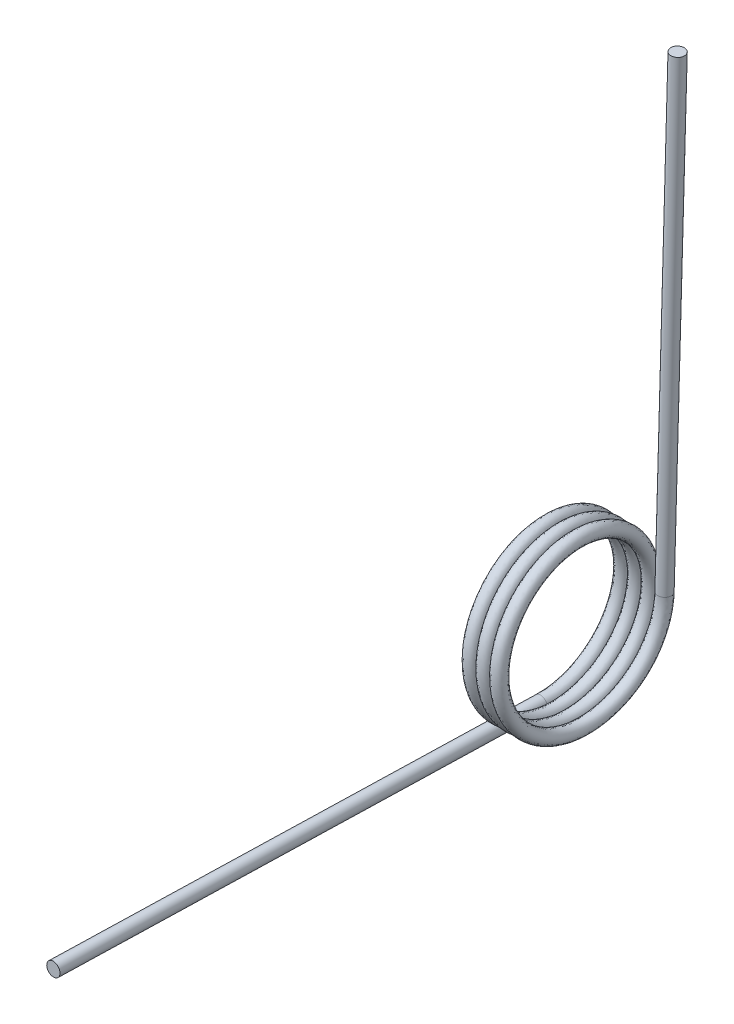
ISO-10303-21;
HEADER;
FILE_DESCRIPTION(('STEP AP214'),'2;1');
FILE_NAME('part.step','',(''),(''),'','','');
FILE_SCHEMA(('AUTOMOTIVE_DESIGN { 1 0 10303 214 1 1 1 1 }'));
ENDSEC;
DATA;
#1=APPLICATION_CONTEXT('core data for automotive mechanical design processes');
#2=APPLICATION_PROTOCOL_DEFINITION('international standard','automotive_design',2000,#1);
#3=PRODUCT_CONTEXT('',#1,'mechanical');
#4=PRODUCT('Part','Part','',(#3));
#5=PRODUCT_RELATED_PRODUCT_CATEGORY('part','',(#4));
#6=PRODUCT_DEFINITION_FORMATION('','',#4);
#7=PRODUCT_DEFINITION_CONTEXT('part definition',#1,'design');
#8=PRODUCT_DEFINITION('design','',#6,#7);
#9=PRODUCT_DEFINITION_SHAPE('','',#8);
#10=(LENGTH_UNIT() NAMED_UNIT(*) SI_UNIT(.MILLI.,.METRE.));
#11=(NAMED_UNIT(*) PLANE_ANGLE_UNIT() SI_UNIT($,.RADIAN.));
#12=(NAMED_UNIT(*) SI_UNIT($,.STERADIAN.) SOLID_ANGLE_UNIT());
#13=UNCERTAINTY_MEASURE_WITH_UNIT(LENGTH_MEASURE(1.E-05),#10,'distance_accuracy_value','');
#14=(GEOMETRIC_REPRESENTATION_CONTEXT(3) GLOBAL_UNCERTAINTY_ASSIGNED_CONTEXT((#13)) GLOBAL_UNIT_ASSIGNED_CONTEXT((#10,
#11,#12)) REPRESENTATION_CONTEXT('',''));
#15=CARTESIAN_POINT('',(0.,0.,0.));
#16=DIRECTION('',(0.,0.,1.));
#17=DIRECTION('',(1.,0.,0.));
#18=AXIS2_PLACEMENT_3D('',#15,#16,#17);
#19=CARTESIAN_POINT('',(-1.45994168900246,-16.9545,-0.0403796323986165));
#20=CARTESIAN_POINT('',(-1.21440835566913,-16.9311868083649,-9.82906477137413));
#21=CARTESIAN_POINT('',(-0.968875022335798,-8.44228021254733,-14.7032175246626));
#22=CARTESIAN_POINT('',(-0.723341689002465,0.0466263832702375,-19.577370277951));
#23=CARTESIAN_POINT('',(-0.477808355669132,8.51221978745268,-14.662837892264));
#24=CARTESIAN_POINT('',(-0.2322750223358,16.9778131916351,-9.74830550657691));
#25=CARTESIAN_POINT('',(0.0132583109975334,16.9545,0.0403796323986144));
#26=CARTESIAN_POINT('',(0.258791644330866,16.9311868083649,9.82906477137412));
#27=CARTESIAN_POINT('',(0.504324977664199,8.44228021254733,14.7032175246626));
#28=CARTESIAN_POINT('',(0.749858310997532,-0.0466263832702351,19.577370277951));
#29=CARTESIAN_POINT('',(0.995391644330864,-8.51221978745267,14.662837892264));
#30=CARTESIAN_POINT('',(1.2409249776642,-16.9778131916351,9.74830550657691));
#31=CARTESIAN_POINT('',(1.48645831099753,-16.9545,-0.0403796323986165));
#32=CARTESIAN_POINT('',(1.73199164433086,-16.9311868083649,-9.82906477137413));
#33=CARTESIAN_POINT('',(1.9775249776642,-8.44228021254733,-14.7032175246626));
#34=CARTESIAN_POINT('',(2.22305831099753,0.0466263832702375,-19.577370277951));
#35=CARTESIAN_POINT('',(2.46859164433086,8.51221978745268,-14.662837892264));
#36=CARTESIAN_POINT('',(2.71412497766419,16.9778131916351,-9.74830550657691));
#37=CARTESIAN_POINT('',(2.95965831099753,16.9545,0.0403796323986144));
#38=CARTESIAN_POINT('',(3.20519164433086,16.9311868083649,9.82906477137412));
#39=CARTESIAN_POINT('',(3.45072497766419,8.44228021254733,14.7032175246626));
#40=CARTESIAN_POINT('',(3.69625831099753,-0.0466263832702351,19.577370277951));
#41=CARTESIAN_POINT('',(3.94179164433086,-8.51221978745267,14.662837892264));
#42=CARTESIAN_POINT('',(4.18732497766419,-16.9778131916351,9.74830550657691));
#43=CARTESIAN_POINT('',(4.43285831099752,-16.9545,-0.0403796323986165));
#44=CARTESIAN_POINT('',(4.67839164433086,-16.9311868083649,-9.82906477137413));
#45=CARTESIAN_POINT('',(4.92392497766419,-8.44228021254733,-14.7032175246626));
#46=CARTESIAN_POINT('',(5.16945831099752,0.0466263832702375,-19.577370277951));
#47=CARTESIAN_POINT('',(5.41499164433086,8.51221978745268,-14.662837892264));
#48=CARTESIAN_POINT('',(5.66052497766419,16.9778131916351,-9.74830550657691));
#49=CARTESIAN_POINT('',(5.90605831099752,16.9545,0.0403796323986144));
#50=CARTESIAN_POINT('',(6.15159164433085,16.9311868083649,9.82906477137412));
#51=CARTESIAN_POINT('',(6.39712497766419,8.44228021254733,14.7032175246626));
#52=CARTESIAN_POINT('',(6.64265831099752,-0.0466263832702351,19.577370277951));
#53=CARTESIAN_POINT('',(6.88819164433085,-8.51221978745267,14.662837892264));
#54=CARTESIAN_POINT('',(7.13372497766419,-16.9778131916351,9.74830550657691));
#55=CARTESIAN_POINT('',(7.37925831099752,-16.9545,-0.0403796323986165));
#56=CARTESIAN_POINT('',(7.62479164433085,-16.9311868083649,-9.82906477137413));
#57=CARTESIAN_POINT('',(7.87032497766418,-8.44228021254733,-14.7032175246626));
#58=CARTESIAN_POINT('',(8.11585831099752,0.0466263832702375,-19.577370277951));
#59=CARTESIAN_POINT('',(8.36139164433085,8.51221978745268,-14.662837892264));
#60=CARTESIAN_POINT('',(8.60692497766418,16.9778131916351,-9.74830550657691));
#61=CARTESIAN_POINT('',(8.85245831099751,16.9545,0.0403796323986144));
#62=CARTESIAN_POINT('',(9.09799164433085,16.9311868083649,9.82906477137412));
#63=CARTESIAN_POINT('',(9.34352497766418,8.44228021254733,14.7032175246626));
#64=CARTESIAN_POINT('',(9.58905831099751,-0.0466263832702351,19.577370277951));
#65=CARTESIAN_POINT('',(9.83459164433085,-8.51221978745267,14.662837892264));
#66=CARTESIAN_POINT('',(10.0801249776642,-16.9778131916351,9.74830550657691));
#67=CARTESIAN_POINT('',(10.3256583109975,-16.9545,-0.0403796323986165));
#68=CARTESIAN_POINT('',(-1.45994168900246,-14.0335,-0.0403796323985853));
#69=CARTESIAN_POINT('',(-1.21440835566913,-14.0101868083649,-8.1426246350712));
#70=CARTESIAN_POINT('',(-0.968875022335799,-6.98178021254735,-12.1735573202082));
#71=CARTESIAN_POINT('',(-0.723341689002466,0.0466263832702017,-16.2044900053452));
#72=CARTESIAN_POINT('',(-0.477808355669133,7.05171978745265,-12.1331776878096));
#73=CARTESIAN_POINT('',(-0.2322750223358,14.0568131916351,-8.06186537027404));
#74=CARTESIAN_POINT('',(0.0132583109975326,14.0335,0.0403796323985836));
#75=CARTESIAN_POINT('',(0.258791644330865,14.0101868083649,8.1426246350712));
#76=CARTESIAN_POINT('',(0.504324977664198,6.98178021254736,12.1735573202082));
#77=CARTESIAN_POINT('',(0.749858310997531,-0.0466263832701997,16.2044900053452));
#78=CARTESIAN_POINT('',(0.995391644330864,-7.05171978745265,12.1331776878096));
#79=CARTESIAN_POINT('',(1.2409249776642,-14.0568131916351,8.06186537027404));
#80=CARTESIAN_POINT('',(1.48645831099753,-14.0335,-0.0403796323985853));
#81=CARTESIAN_POINT('',(1.73199164433086,-14.0101868083649,-8.1426246350712));
#82=CARTESIAN_POINT('',(1.97752497766419,-6.98178021254735,-12.1735573202082));
#83=CARTESIAN_POINT('',(2.22305831099753,0.0466263832702017,-16.2044900053452));
#84=CARTESIAN_POINT('',(2.46859164433086,7.05171978745265,-12.1331776878096));
#85=CARTESIAN_POINT('',(2.71412497766419,14.0568131916351,-8.06186537027404));
#86=CARTESIAN_POINT('',(2.95965831099753,14.0335,0.0403796323985836));
#87=CARTESIAN_POINT('',(3.20519164433086,14.0101868083649,8.1426246350712));
#88=CARTESIAN_POINT('',(3.45072497766419,6.98178021254736,12.1735573202082));
#89=CARTESIAN_POINT('',(3.69625831099752,-0.0466263832701997,16.2044900053452));
#90=CARTESIAN_POINT('',(3.94179164433086,-7.05171978745265,12.1331776878096));
#91=CARTESIAN_POINT('',(4.18732497766419,-14.0568131916351,8.06186537027404));
#92=CARTESIAN_POINT('',(4.43285831099752,-14.0335,-0.0403796323985853));
#93=CARTESIAN_POINT('',(4.67839164433086,-14.0101868083649,-8.1426246350712));
#94=CARTESIAN_POINT('',(4.92392497766419,-6.98178021254735,-12.1735573202082));
#95=CARTESIAN_POINT('',(5.16945831099752,0.0466263832702017,-16.2044900053452));
#96=CARTESIAN_POINT('',(5.41499164433085,7.05171978745265,-12.1331776878096));
#97=CARTESIAN_POINT('',(5.66052497766419,14.0568131916351,-8.06186537027404));
#98=CARTESIAN_POINT('',(5.90605831099752,14.0335,0.0403796323985836));
#99=CARTESIAN_POINT('',(6.15159164433085,14.0101868083649,8.1426246350712));
#100=CARTESIAN_POINT('',(6.39712497766418,6.98178021254736,12.1735573202082));
#101=CARTESIAN_POINT('',(6.64265831099752,-0.0466263832701997,16.2044900053452));
#102=CARTESIAN_POINT('',(6.88819164433085,-7.05171978745265,12.1331776878096));
#103=CARTESIAN_POINT('',(7.13372497766418,-14.0568131916351,8.06186537027404));
#104=CARTESIAN_POINT('',(7.37925831099752,-14.0335,-0.0403796323985853));
#105=CARTESIAN_POINT('',(7.62479164433085,-14.0101868083649,-8.1426246350712));
#106=CARTESIAN_POINT('',(7.87032497766418,-6.98178021254735,-12.1735573202082));
#107=CARTESIAN_POINT('',(8.11585831099752,0.0466263832702017,-16.2044900053452));
#108=CARTESIAN_POINT('',(8.36139164433085,7.05171978745265,-12.1331776878096));
#109=CARTESIAN_POINT('',(8.60692497766418,14.0568131916351,-8.06186537027404));
#110=CARTESIAN_POINT('',(8.85245831099751,14.0335,0.0403796323985836));
#111=CARTESIAN_POINT('',(9.09799164433085,14.0101868083649,8.1426246350712));
#112=CARTESIAN_POINT('',(9.34352497766418,6.98178021254736,12.1735573202082));
#113=CARTESIAN_POINT('',(9.58905831099751,-0.0466263832701997,16.2044900053452));
#114=CARTESIAN_POINT('',(9.83459164433085,-7.05171978745265,12.1331776878096));
#115=CARTESIAN_POINT('',(10.0801249776642,-14.0568131916351,8.06186537027404));
#116=CARTESIAN_POINT('',(10.3256583109975,-14.0335,-0.0403796323985853));
#117=CARTESIAN_POINT('',(1.45994168900246,-14.0335,0.0403796323982926));
#118=CARTESIAN_POINT('',(1.7054750223358,-14.0568131916349,-8.06186537027432));
#119=CARTESIAN_POINT('',(1.95100835566913,-7.05171978745241,-12.1331776878098));
#120=CARTESIAN_POINT('',(2.19654168900246,-0.0466263832698657,-16.2044900053452));
#121=CARTESIAN_POINT('',(2.44207502233579,6.9817802125476,-12.1735573202081));
#122=CARTESIAN_POINT('',(2.68760835566913,14.0101868083651,-8.14262463507092));
#123=CARTESIAN_POINT('',(2.93314168900246,14.0335,-0.0403796323982943));
#124=CARTESIAN_POINT('',(3.17867502233579,14.0568131916349,8.06186537027432));
#125=CARTESIAN_POINT('',(3.42420835566913,7.05171978745241,12.1331776878098));
#126=CARTESIAN_POINT('',(3.66974168900246,0.0466263832698676,16.2044900053452));
#127=CARTESIAN_POINT('',(3.91527502233579,-6.9817802125476,12.1735573202081));
#128=CARTESIAN_POINT('',(4.16080835566912,-14.0101868083651,8.14262463507092));
#129=CARTESIAN_POINT('',(4.40634168900246,-14.0335,0.0403796323982926));
#130=CARTESIAN_POINT('',(4.65187502233579,-14.0568131916349,-8.06186537027432));
#131=CARTESIAN_POINT('',(4.89740835566912,-7.05171978745241,-12.1331776878098));
#132=CARTESIAN_POINT('',(5.14294168900245,-0.0466263832698657,-16.2044900053452));
#133=CARTESIAN_POINT('',(5.38847502233579,6.9817802125476,-12.1735573202081));
#134=CARTESIAN_POINT('',(5.63400835566912,14.0101868083651,-8.14262463507092));
#135=CARTESIAN_POINT('',(5.87954168900245,14.0335,-0.0403796323982943));
#136=CARTESIAN_POINT('',(6.12507502233579,14.0568131916349,8.06186537027432));
#137=CARTESIAN_POINT('',(6.37060835566912,7.05171978745241,12.1331776878098));
#138=CARTESIAN_POINT('',(6.61614168900245,0.0466263832698676,16.2044900053452));
#139=CARTESIAN_POINT('',(6.86167502233578,-6.9817802125476,12.1735573202081));
#140=CARTESIAN_POINT('',(7.10720835566912,-14.0101868083651,8.14262463507092));
#141=CARTESIAN_POINT('',(7.35274168900245,-14.0335,0.0403796323982926));
#142=CARTESIAN_POINT('',(7.59827502233578,-14.0568131916349,-8.06186537027432));
#143=CARTESIAN_POINT('',(7.84380835566912,-7.05171978745241,-12.1331776878098));
#144=CARTESIAN_POINT('',(8.08934168900245,-0.0466263832698657,-16.2044900053452));
#145=CARTESIAN_POINT('',(8.33487502233578,6.9817802125476,-12.1735573202081));
#146=CARTESIAN_POINT('',(8.58040835566912,14.0101868083651,-8.14262463507092));
#147=CARTESIAN_POINT('',(8.82594168900245,14.0335,-0.0403796323982943));
#148=CARTESIAN_POINT('',(9.07147502233578,14.0568131916349,8.06186537027432));
#149=CARTESIAN_POINT('',(9.31700835566911,7.05171978745241,12.1331776878098));
#150=CARTESIAN_POINT('',(9.56254168900244,0.0466263832698676,16.2044900053452));
#151=CARTESIAN_POINT('',(9.80807502233578,-6.9817802125476,12.1735573202081));
#152=CARTESIAN_POINT('',(10.0536083556691,-14.0101868083651,8.14262463507092));
#153=CARTESIAN_POINT('',(10.2991416890024,-14.0335,0.0403796323982926));
#154=CARTESIAN_POINT('',(10.5446750223358,-14.0568131916349,-8.06186537027432));
#155=CARTESIAN_POINT('',(10.7902083556691,-7.05171978745241,-12.1331776878098));
#156=CARTESIAN_POINT('',(11.0357416890024,-0.0466263832698657,-16.2044900053452));
#157=CARTESIAN_POINT('',(11.2812750223358,6.9817802125476,-12.1735573202081));
#158=CARTESIAN_POINT('',(11.5268083556691,14.0101868083651,-8.14262463507092));
#159=CARTESIAN_POINT('',(11.7723416890024,14.0335,-0.0403796323982943));
#160=CARTESIAN_POINT('',(12.0178750223358,14.0568131916349,8.06186537027432));
#161=CARTESIAN_POINT('',(12.2634083556691,7.05171978745241,12.1331776878098));
#162=CARTESIAN_POINT('',(12.5089416890024,0.0466263832698676,16.2044900053452));
#163=CARTESIAN_POINT('',(12.7544750223358,-6.9817802125476,12.1735573202081));
#164=CARTESIAN_POINT('',(13.0000083556691,-14.0101868083651,8.14262463507092));
#165=CARTESIAN_POINT('',(13.2455416890024,-14.0335,0.0403796323982926));
#166=CARTESIAN_POINT('',(1.45994168900246,-16.9545,0.0403796323982613));
#167=CARTESIAN_POINT('',(1.7054750223358,-16.9778131916349,-9.74830550657725));
#168=CARTESIAN_POINT('',(1.95100835566913,-8.51221978745238,-14.6628378922641));
#169=CARTESIAN_POINT('',(2.19654168900246,-0.0466263832698298,-19.577370277951));
#170=CARTESIAN_POINT('',(2.4420750223358,8.44228021254763,-14.7032175246624));
#171=CARTESIAN_POINT('',(2.68760835566913,16.9311868083651,-9.82906477137378));
#172=CARTESIAN_POINT('',(2.93314168900246,16.9545,-0.0403796323982634));
#173=CARTESIAN_POINT('',(3.17867502233579,16.9778131916349,9.74830550657725));
#174=CARTESIAN_POINT('',(3.42420835566913,8.51221978745238,14.6628378922641));
#175=CARTESIAN_POINT('',(3.66974168900246,0.0466263832698322,19.577370277951));
#176=CARTESIAN_POINT('',(3.91527502233579,-8.44228021254762,14.7032175246624));
#177=CARTESIAN_POINT('',(4.16080835566912,-16.9311868083651,9.82906477137379));
#178=CARTESIAN_POINT('',(4.40634168900246,-16.9545,0.0403796323982613));
#179=CARTESIAN_POINT('',(4.65187502233579,-16.9778131916349,-9.74830550657725));
#180=CARTESIAN_POINT('',(4.89740835566912,-8.51221978745238,-14.6628378922641));
#181=CARTESIAN_POINT('',(5.14294168900246,-0.0466263832698298,-19.577370277951));
#182=CARTESIAN_POINT('',(5.38847502233579,8.44228021254763,-14.7032175246624));
#183=CARTESIAN_POINT('',(5.63400835566912,16.9311868083651,-9.82906477137378));
#184=CARTESIAN_POINT('',(5.87954168900245,16.9545,-0.0403796323982634));
#185=CARTESIAN_POINT('',(6.12507502233579,16.9778131916349,9.74830550657725));
#186=CARTESIAN_POINT('',(6.37060835566912,8.51221978745238,14.6628378922641));
#187=CARTESIAN_POINT('',(6.61614168900245,0.0466263832698322,19.577370277951));
#188=CARTESIAN_POINT('',(6.86167502233579,-8.44228021254762,14.7032175246624));
#189=CARTESIAN_POINT('',(7.10720835566912,-16.9311868083651,9.82906477137379));
#190=CARTESIAN_POINT('',(7.35274168900245,-16.9545,0.0403796323982613));
#191=CARTESIAN_POINT('',(7.59827502233578,-16.9778131916349,-9.74830550657725));
#192=CARTESIAN_POINT('',(7.84380835566912,-8.51221978745238,-14.6628378922641));
#193=CARTESIAN_POINT('',(8.08934168900245,-0.0466263832698298,-19.577370277951));
#194=CARTESIAN_POINT('',(8.33487502233578,8.44228021254763,-14.7032175246624));
#195=CARTESIAN_POINT('',(8.58040835566912,16.9311868083651,-9.82906477137378));
#196=CARTESIAN_POINT('',(8.82594168900245,16.9545,-0.0403796323982634));
#197=CARTESIAN_POINT('',(9.07147502233578,16.9778131916349,9.74830550657725));
#198=CARTESIAN_POINT('',(9.31700835566911,8.51221978745238,14.6628378922641));
#199=CARTESIAN_POINT('',(9.56254168900245,0.0466263832698322,19.577370277951));
#200=CARTESIAN_POINT('',(9.80807502233578,-8.44228021254762,14.7032175246624));
#201=CARTESIAN_POINT('',(10.0536083556691,-16.9311868083651,9.82906477137379));
#202=CARTESIAN_POINT('',(10.2991416890024,-16.9545,0.0403796323982613));
#203=CARTESIAN_POINT('',(10.5446750223358,-16.9778131916349,-9.74830550657725));
#204=CARTESIAN_POINT('',(10.7902083556691,-8.51221978745238,-14.6628378922641));
#205=CARTESIAN_POINT('',(11.0357416890024,-0.0466263832698298,-19.577370277951));
#206=CARTESIAN_POINT('',(11.2812750223358,8.44228021254763,-14.7032175246624));
#207=CARTESIAN_POINT('',(11.5268083556691,16.9311868083651,-9.82906477137378));
#208=CARTESIAN_POINT('',(11.7723416890024,16.9545,-0.0403796323982634));
#209=CARTESIAN_POINT('',(12.0178750223358,16.9778131916349,9.74830550657725));
#210=CARTESIAN_POINT('',(12.2634083556691,8.51221978745238,14.6628378922641));
#211=CARTESIAN_POINT('',(12.5089416890024,0.0466263832698322,19.577370277951));
#212=CARTESIAN_POINT('',(12.7544750223358,-8.44228021254762,14.7032175246624));
#213=CARTESIAN_POINT('',(13.0000083556691,-16.9311868083651,9.82906477137379));
#214=CARTESIAN_POINT('',(13.2455416890024,-16.9545,0.0403796323982613));
#215=CARTESIAN_POINT('',(1.45994168900247,-19.8755,0.0403796323982301));
#216=CARTESIAN_POINT('',(1.7054750223358,-19.8988131916349,-11.4347456428802));
#217=CARTESIAN_POINT('',(1.95100835566913,-9.97271978745235,-17.1924980967185));
#218=CARTESIAN_POINT('',(2.19654168900246,-0.046626383269794,-22.9502505505568));
#219=CARTESIAN_POINT('',(2.4420750223358,9.90278021254765,-17.2328777291167));
#220=CARTESIAN_POINT('',(2.68760835566913,19.8521868083651,-11.5155049076766));
#221=CARTESIAN_POINT('',(2.93314168900246,19.8755,-0.0403796323982326));
#222=CARTESIAN_POINT('',(3.1786750223358,19.8988131916349,11.4347456428802));
#223=CARTESIAN_POINT('',(3.42420835566913,9.97271978745236,17.1924980967185));
#224=CARTESIAN_POINT('',(3.66974168900246,0.0466263832697968,22.9502505505568));
#225=CARTESIAN_POINT('',(3.91527502233579,-9.90278021254765,17.2328777291167));
#226=CARTESIAN_POINT('',(4.16080835566913,-19.8521868083651,11.5155049076767));
#227=CARTESIAN_POINT('',(4.40634168900246,-19.8755,0.0403796323982301));
#228=CARTESIAN_POINT('',(4.65187502233579,-19.8988131916349,-11.4347456428802));
#229=CARTESIAN_POINT('',(4.89740835566912,-9.97271978745235,-17.1924980967185));
#230=CARTESIAN_POINT('',(5.14294168900246,-0.046626383269794,-22.9502505505568));
#231=CARTESIAN_POINT('',(5.38847502233579,9.90278021254765,-17.2328777291167));
#232=CARTESIAN_POINT('',(5.63400835566912,19.8521868083651,-11.5155049076766));
#233=CARTESIAN_POINT('',(5.87954168900246,19.8755,-0.0403796323982326));
#234=CARTESIAN_POINT('',(6.12507502233579,19.8988131916349,11.4347456428802));
#235=CARTESIAN_POINT('',(6.37060835566912,9.97271978745236,17.1924980967185));
#236=CARTESIAN_POINT('',(6.61614168900245,0.0466263832697968,22.9502505505568));
#237=CARTESIAN_POINT('',(6.86167502233579,-9.90278021254765,17.2328777291167));
#238=CARTESIAN_POINT('',(7.10720835566912,-19.8521868083651,11.5155049076767));
#239=CARTESIAN_POINT('',(7.35274168900245,-19.8755,0.0403796323982301));
#240=CARTESIAN_POINT('',(7.59827502233579,-19.8988131916349,-11.4347456428802));
#241=CARTESIAN_POINT('',(7.84380835566912,-9.97271978745235,-17.1924980967185));
#242=CARTESIAN_POINT('',(8.08934168900245,-0.046626383269794,-22.9502505505568));
#243=CARTESIAN_POINT('',(8.33487502233579,9.90278021254765,-17.2328777291167));
#244=CARTESIAN_POINT('',(8.58040835566912,19.8521868083651,-11.5155049076766));
#245=CARTESIAN_POINT('',(8.82594168900245,19.8755,-0.0403796323982326));
#246=CARTESIAN_POINT('',(9.07147502233578,19.8988131916349,11.4347456428802));
#247=CARTESIAN_POINT('',(9.31700835566912,9.97271978745236,17.1924980967185));
#248=CARTESIAN_POINT('',(9.56254168900245,0.0466263832697968,22.9502505505568));
#249=CARTESIAN_POINT('',(9.80807502233578,-9.90278021254765,17.2328777291167));
#250=CARTESIAN_POINT('',(10.0536083556691,-19.8521868083651,11.5155049076767));
#251=CARTESIAN_POINT('',(10.2991416890024,-19.8755,0.0403796323982301));
#252=CARTESIAN_POINT('',(10.5446750223358,-19.8988131916349,-11.4347456428802));
#253=CARTESIAN_POINT('',(10.7902083556691,-9.97271978745235,-17.1924980967185));
#254=CARTESIAN_POINT('',(11.0357416890024,-0.046626383269794,-22.9502505505568));
#255=CARTESIAN_POINT('',(11.2812750223358,9.90278021254765,-17.2328777291167));
#256=CARTESIAN_POINT('',(11.5268083556691,19.8521868083651,-11.5155049076766));
#257=CARTESIAN_POINT('',(11.7723416890024,19.8755,-0.0403796323982326));
#258=CARTESIAN_POINT('',(12.0178750223358,19.8988131916349,11.4347456428802));
#259=CARTESIAN_POINT('',(12.2634083556691,9.97271978745236,17.1924980967185));
#260=CARTESIAN_POINT('',(12.5089416890024,0.0466263832697968,22.9502505505568));
#261=CARTESIAN_POINT('',(12.7544750223358,-9.90278021254765,17.2328777291167));
#262=CARTESIAN_POINT('',(13.0000083556691,-19.8521868083651,11.5155049076767));
#263=CARTESIAN_POINT('',(13.2455416890024,-19.8755,0.0403796323982301));
#264=CARTESIAN_POINT('',(-1.45994168900246,-19.8755,-0.0403796323986477));
#265=CARTESIAN_POINT('',(-1.21440835566913,-19.8521868083649,-11.5155049076771));
#266=CARTESIAN_POINT('',(-0.968875022335797,-9.9027802125473,-17.2328777291169));
#267=CARTESIAN_POINT('',(-0.723341689002464,0.0466263832702734,-22.9502505505568));
#268=CARTESIAN_POINT('',(-0.477808355669131,9.97271978745271,-17.1924980967183));
#269=CARTESIAN_POINT('',(-0.232275022335799,19.8988131916351,-11.4347456428798));
#270=CARTESIAN_POINT('',(0.0132583109975343,19.8755,0.0403796323986453));
#271=CARTESIAN_POINT('',(0.258791644330867,19.8521868083649,11.5155049076771));
#272=CARTESIAN_POINT('',(0.5043249776642,9.90278021254731,17.2328777291169));
#273=CARTESIAN_POINT('',(0.749858310997533,-0.0466263832702706,22.9502505505568));
#274=CARTESIAN_POINT('',(0.995391644330865,-9.9727197874527,17.1924980967183));
#275=CARTESIAN_POINT('',(1.2409249776642,-19.8988131916351,11.4347456428798));
#276=CARTESIAN_POINT('',(1.48645831099753,-19.8755,-0.0403796323986477));
#277=CARTESIAN_POINT('',(1.73199164433086,-19.8521868083649,-11.5155049076771));
#278=CARTESIAN_POINT('',(1.9775249776642,-9.9027802125473,-17.2328777291169));
#279=CARTESIAN_POINT('',(2.22305831099753,0.0466263832702734,-22.9502505505568));
#280=CARTESIAN_POINT('',(2.46859164433086,9.97271978745271,-17.1924980967183));
#281=CARTESIAN_POINT('',(2.7141249776642,19.8988131916351,-11.4347456428798));
#282=CARTESIAN_POINT('',(2.95965831099753,19.8755,0.0403796323986453));
#283=CARTESIAN_POINT('',(3.20519164433086,19.8521868083649,11.5155049076771));
#284=CARTESIAN_POINT('',(3.45072497766419,9.90278021254731,17.2328777291169));
#285=CARTESIAN_POINT('',(3.69625831099753,-0.0466263832702706,22.9502505505568));
#286=CARTESIAN_POINT('',(3.94179164433086,-9.9727197874527,17.1924980967183));
#287=CARTESIAN_POINT('',(4.18732497766419,-19.8988131916351,11.4347456428798));
#288=CARTESIAN_POINT('',(4.43285831099753,-19.8755,-0.0403796323986477));
#289=CARTESIAN_POINT('',(4.67839164433086,-19.8521868083649,-11.5155049076771));
#290=CARTESIAN_POINT('',(4.92392497766419,-9.9027802125473,-17.2328777291169));
#291=CARTESIAN_POINT('',(5.16945831099752,0.0466263832702734,-22.9502505505568));
#292=CARTESIAN_POINT('',(5.41499164433086,9.97271978745271,-17.1924980967183));
#293=CARTESIAN_POINT('',(5.66052497766419,19.8988131916351,-11.4347456428798));
#294=CARTESIAN_POINT('',(5.90605831099752,19.8755,0.0403796323986453));
#295=CARTESIAN_POINT('',(6.15159164433086,19.8521868083649,11.5155049076771));
#296=CARTESIAN_POINT('',(6.39712497766419,9.90278021254731,17.2328777291169));
#297=CARTESIAN_POINT('',(6.64265831099752,-0.0466263832702706,22.9502505505568));
#298=CARTESIAN_POINT('',(6.88819164433085,-9.9727197874527,17.1924980967183));
#299=CARTESIAN_POINT('',(7.13372497766419,-19.8988131916351,11.4347456428798));
#300=CARTESIAN_POINT('',(7.37925831099752,-19.8755,-0.0403796323986477));
#301=CARTESIAN_POINT('',(7.62479164433085,-19.8521868083649,-11.5155049076771));
#302=CARTESIAN_POINT('',(7.87032497766419,-9.9027802125473,-17.2328777291169));
#303=CARTESIAN_POINT('',(8.11585831099752,0.0466263832702734,-22.9502505505568));
#304=CARTESIAN_POINT('',(8.36139164433085,9.97271978745271,-17.1924980967183));
#305=CARTESIAN_POINT('',(8.60692497766418,19.8988131916351,-11.4347456428798));
#306=CARTESIAN_POINT('',(8.85245831099752,19.8755,0.0403796323986453));
#307=CARTESIAN_POINT('',(9.09799164433085,19.8521868083649,11.5155049076771));
#308=CARTESIAN_POINT('',(9.34352497766418,9.90278021254731,17.2328777291169));
#309=CARTESIAN_POINT('',(9.58905831099752,-0.0466263832702706,22.9502505505568));
#310=CARTESIAN_POINT('',(9.83459164433085,-9.9727197874527,17.1924980967183));
#311=CARTESIAN_POINT('',(10.0801249776642,-19.8988131916351,11.4347456428798));
#312=CARTESIAN_POINT('',(10.3256583109975,-19.8755,-0.0403796323986477));
#313=CARTESIAN_POINT('',(-1.45994168900246,-16.9545,-0.0403796323986165));
#314=CARTESIAN_POINT('',(-1.21440835566913,-16.9311868083649,-9.82906477137413));
#315=CARTESIAN_POINT('',(-0.968875022335798,-8.44228021254733,-14.7032175246626));
#316=CARTESIAN_POINT('',(-0.723341689002465,0.0466263832702375,-19.577370277951));
#317=CARTESIAN_POINT('',(-0.477808355669132,8.51221978745268,-14.662837892264));
#318=CARTESIAN_POINT('',(-0.2322750223358,16.9778131916351,-9.74830550657691));
#319=CARTESIAN_POINT('',(0.0132583109975334,16.9545,0.0403796323986144));
#320=CARTESIAN_POINT('',(0.258791644330866,16.9311868083649,9.82906477137412));
#321=CARTESIAN_POINT('',(0.504324977664199,8.44228021254733,14.7032175246626));
#322=CARTESIAN_POINT('',(0.749858310997532,-0.0466263832702351,19.577370277951));
#323=CARTESIAN_POINT('',(0.995391644330864,-8.51221978745267,14.662837892264));
#324=CARTESIAN_POINT('',(1.2409249776642,-16.9778131916351,9.74830550657691));
#325=CARTESIAN_POINT('',(1.48645831099753,-16.9545,-0.0403796323986165));
#326=CARTESIAN_POINT('',(1.73199164433086,-16.9311868083649,-9.82906477137413));
#327=CARTESIAN_POINT('',(1.9775249776642,-8.44228021254733,-14.7032175246626));
#328=CARTESIAN_POINT('',(2.22305831099753,0.0466263832702375,-19.577370277951));
#329=CARTESIAN_POINT('',(2.46859164433086,8.51221978745268,-14.662837892264));
#330=CARTESIAN_POINT('',(2.71412497766419,16.9778131916351,-9.74830550657691));
#331=CARTESIAN_POINT('',(2.95965831099753,16.9545,0.0403796323986144));
#332=CARTESIAN_POINT('',(3.20519164433086,16.9311868083649,9.82906477137412));
#333=CARTESIAN_POINT('',(3.45072497766419,8.44228021254733,14.7032175246626));
#334=CARTESIAN_POINT('',(3.69625831099753,-0.0466263832702351,19.577370277951));
#335=CARTESIAN_POINT('',(3.94179164433086,-8.51221978745267,14.662837892264));
#336=CARTESIAN_POINT('',(4.18732497766419,-16.9778131916351,9.74830550657691));
#337=CARTESIAN_POINT('',(4.43285831099752,-16.9545,-0.0403796323986165));
#338=CARTESIAN_POINT('',(4.67839164433086,-16.9311868083649,-9.82906477137413));
#339=CARTESIAN_POINT('',(4.92392497766419,-8.44228021254733,-14.7032175246626));
#340=CARTESIAN_POINT('',(5.16945831099752,0.0466263832702375,-19.577370277951));
#341=CARTESIAN_POINT('',(5.41499164433086,8.51221978745268,-14.662837892264));
#342=CARTESIAN_POINT('',(5.66052497766419,16.9778131916351,-9.74830550657691));
#343=CARTESIAN_POINT('',(5.90605831099752,16.9545,0.0403796323986144));
#344=CARTESIAN_POINT('',(6.15159164433085,16.9311868083649,9.82906477137412));
#345=CARTESIAN_POINT('',(6.39712497766419,8.44228021254733,14.7032175246626));
#346=CARTESIAN_POINT('',(6.64265831099752,-0.0466263832702351,19.577370277951));
#347=CARTESIAN_POINT('',(6.88819164433085,-8.51221978745267,14.662837892264));
#348=CARTESIAN_POINT('',(7.13372497766419,-16.9778131916351,9.74830550657691));
#349=CARTESIAN_POINT('',(7.37925831099752,-16.9545,-0.0403796323986165));
#350=CARTESIAN_POINT('',(7.62479164433085,-16.9311868083649,-9.82906477137413));
#351=CARTESIAN_POINT('',(7.87032497766418,-8.44228021254733,-14.7032175246626));
#352=CARTESIAN_POINT('',(8.11585831099752,0.0466263832702375,-19.577370277951));
#353=CARTESIAN_POINT('',(8.36139164433085,8.51221978745268,-14.662837892264));
#354=CARTESIAN_POINT('',(8.60692497766418,16.9778131916351,-9.74830550657691));
#355=CARTESIAN_POINT('',(8.85245831099751,16.9545,0.0403796323986144));
#356=CARTESIAN_POINT('',(9.09799164433085,16.9311868083649,9.82906477137412));
#357=CARTESIAN_POINT('',(9.34352497766418,8.44228021254733,14.7032175246626));
#358=CARTESIAN_POINT('',(9.58905831099751,-0.0466263832702351,19.577370277951));
#359=CARTESIAN_POINT('',(9.83459164433085,-8.51221978745267,14.662837892264));
#360=CARTESIAN_POINT('',(10.0801249776642,-16.9778131916351,9.74830550657691));
#361=CARTESIAN_POINT('',(10.3256583109975,-16.9545,-0.0403796323986165));
#362=(BOUNDED_SURFACE() B_SPLINE_SURFACE(3,2,((#19,#20,#21,#22,#23,#24,#25,#26,#27,#28,#29,#30,
#31,#32,#33,#34,#35,#36,#37,#38,#39,#40,#41,#42,#43,#44,#45,#46,#47,#48,#49,#50,#51,#52,#53,#54,
#55,#56,#57,#58,#59,#60,#61,#62,#63,#64,#65,#66,#67),(#68,#69,#70,#71,#72,#73,#74,#75,#76,#77,
#78,#79,#80,#81,#82,#83,#84,#85,#86,#87,#88,#89,#90,#91,#92,#93,#94,#95,#96,#97,#98,#99,#100,
#101,#102,#103,#104,#105,#106,#107,#108,#109,#110,#111,#112,#113,#114,#115,#116),(#117,#118,
#119,#120,#121,#122,#123,#124,#125,#126,#127,#128,#129,#130,#131,#132,#133,#134,#135,#136,#137,
#138,#139,#140,#141,#142,#143,#144,#145,#146,#147,#148,#149,#150,#151,#152,#153,#154,#155,#156,
#157,#158,#159,#160,#161,#162,#163,#164,#165),(#166,#167,#168,#169,#170,#171,#172,#173,#174,
#175,#176,#177,#178,#179,#180,#181,#182,#183,#184,#185,#186,#187,#188,#189,#190,#191,#192,#193,
#194,#195,#196,#197,#198,#199,#200,#201,#202,#203,#204,#205,#206,#207,#208,#209,#210,#211,#212,
#213,#214),(#215,#216,#217,#218,#219,#220,#221,#222,#223,#224,#225,#226,#227,#228,#229,#230,
#231,#232,#233,#234,#235,#236,#237,#238,#239,#240,#241,#242,#243,#244,#245,#246,#247,#248,#249,
#250,#251,#252,#253,#254,#255,#256,#257,#258,#259,#260,#261,#262,#263),(#264,#265,#266,#267,
#268,#269,#270,#271,#272,#273,#274,#275,#276,#277,#278,#279,#280,#281,#282,#283,#284,#285,#286,
#287,#288,#289,#290,#291,#292,#293,#294,#295,#296,#297,#298,#299,#300,#301,#302,#303,#304,#305,
#306,#307,#308,#309,#310,#311,#312),(#313,#314,#315,#316,#317,#318,#319,#320,#321,#322,#323,
#324,#325,#326,#327,#328,#329,#330,#331,#332,#333,#334,#335,#336,#337,#338,#339,#340,#341,#342,
#343,#344,#345,#346,#347,#348,#349,#350,#351,#352,#353,#354,#355,#356,#357,#358,#359,#360,
#361)),.UNSPECIFIED.,.T.,.F.,.F.) B_SPLINE_SURFACE_WITH_KNOTS((4,3,4),(3,2,2,2,2,2,2,2,2,2,2,2,
2,2,2,2,2,2,2,2,2,2,2,2,3),(0.,0.5,1.),(0.,0.0416666666666667,0.0833333333333333,0.125,
0.166666666666667,0.208333333333333,0.25,0.291666666666667,0.333333333333333,0.375,
0.416666666666667,0.458333333333333,0.5,0.541666666666667,0.583333333333333,0.625,
0.666666666666667,0.708333333333333,0.75,0.791666666666667,0.833333333333333,0.875,
0.916666666666667,0.958333333333333,1.),
.UNSPECIFIED.) GEOMETRIC_REPRESENTATION_ITEM() RATIONAL_B_SPLINE_SURFACE(((1.,0.866025403784439,
1.,0.866025403784439,1.,0.866025403784439,1.,0.866025403784439,1.,0.866025403784439,1.,
0.866025403784439,1.,0.866025403784439,1.,0.866025403784439,1.,0.866025403784439,1.,
0.866025403784439,1.,0.866025403784439,1.,0.866025403784439,1.,0.866025403784439,1.,
0.866025403784439,1.,0.866025403784439,1.,0.866025403784439,1.,0.866025403784439,1.,
0.866025403784439,1.,0.866025403784439,1.,0.866025403784439,1.,0.866025403784439,1.,
0.866025403784439,1.,0.866025403784439,1.,0.866025403784439,1.),(0.333333333333333,
0.288675134594813,0.333333333333333,0.288675134594813,0.333333333333333,0.288675134594813,
0.333333333333333,0.288675134594813,0.333333333333333,0.288675134594813,0.333333333333333,
0.288675134594813,0.333333333333333,0.288675134594813,0.333333333333333,0.288675134594813,
0.333333333333333,0.288675134594813,0.333333333333333,0.288675134594813,0.333333333333333,
0.288675134594813,0.333333333333333,0.288675134594813,0.333333333333333,0.288675134594813,
0.333333333333333,0.288675134594813,0.333333333333333,0.288675134594813,0.333333333333333,
0.288675134594813,0.333333333333333,0.288675134594813,0.333333333333333,0.288675134594813,
0.333333333333333,0.288675134594813,0.333333333333333,0.288675134594813,0.333333333333333,
0.288675134594813,0.333333333333333,0.288675134594813,0.333333333333333,0.288675134594813,
0.333333333333333,0.288675134594813,0.333333333333333),(0.333333333333333,0.288675134594813,
0.333333333333333,0.288675134594813,0.333333333333333,0.288675134594813,0.333333333333333,
0.288675134594813,0.333333333333333,0.288675134594813,0.333333333333333,0.288675134594813,
0.333333333333333,0.288675134594813,0.333333333333333,0.288675134594813,0.333333333333333,
0.288675134594813,0.333333333333333,0.288675134594813,0.333333333333333,0.288675134594813,
0.333333333333333,0.288675134594813,0.333333333333333,0.288675134594813,0.333333333333333,
0.288675134594813,0.333333333333333,0.288675134594813,0.333333333333333,0.288675134594813,
0.333333333333333,0.288675134594813,0.333333333333333,0.288675134594813,0.333333333333333,
0.288675134594813,0.333333333333333,0.288675134594813,0.333333333333333,0.288675134594813,
0.333333333333333,0.288675134594813,0.333333333333333,0.288675134594813,0.333333333333333,
0.288675134594813,0.333333333333333),(1.,0.866025403784439,1.,0.866025403784439,1.,
0.866025403784439,1.,0.866025403784439,1.,0.866025403784439,1.,0.866025403784439,1.,
0.866025403784439,1.,0.866025403784439,1.,0.866025403784439,1.,0.866025403784439,1.,
0.866025403784439,1.,0.866025403784439,1.,0.866025403784439,1.,0.866025403784439,1.,
0.866025403784439,1.,0.866025403784439,1.,0.866025403784439,1.,0.866025403784439,1.,
0.866025403784439,1.,0.866025403784439,1.,0.866025403784439,1.,0.866025403784439,1.,
0.866025403784439,1.,0.866025403784439,1.),(0.333333333333333,0.288675134594813,
0.333333333333333,0.288675134594813,0.333333333333333,0.288675134594813,0.333333333333333,
0.288675134594813,0.333333333333333,0.288675134594813,0.333333333333333,0.288675134594813,
0.333333333333333,0.288675134594813,0.333333333333333,0.288675134594813,0.333333333333333,
0.288675134594813,0.333333333333333,0.288675134594813,0.333333333333333,0.288675134594813,
0.333333333333333,0.288675134594813,0.333333333333333,0.288675134594813,0.333333333333333,
0.288675134594813,0.333333333333333,0.288675134594813,0.333333333333333,0.288675134594813,
0.333333333333333,0.288675134594813,0.333333333333333,0.288675134594813,0.333333333333333,
0.288675134594813,0.333333333333333,0.288675134594813,0.333333333333333,0.288675134594813,
0.333333333333333,0.288675134594813,0.333333333333333,0.288675134594813,0.333333333333333,
0.288675134594813,0.333333333333333),(0.333333333333333,0.288675134594813,0.333333333333333,
0.288675134594813,0.333333333333333,0.288675134594813,0.333333333333333,0.288675134594813,
0.333333333333333,0.288675134594813,0.333333333333333,0.288675134594813,0.333333333333333,
0.288675134594813,0.333333333333333,0.288675134594813,0.333333333333333,0.288675134594813,
0.333333333333333,0.288675134594813,0.333333333333333,0.288675134594813,0.333333333333333,
0.288675134594813,0.333333333333333,0.288675134594813,0.333333333333333,0.288675134594813,
0.333333333333333,0.288675134594813,0.333333333333333,0.288675134594813,0.333333333333333,
0.288675134594813,0.333333333333333,0.288675134594813,0.333333333333333,0.288675134594813,
0.333333333333333,0.288675134594813,0.333333333333333,0.288675134594813,0.333333333333333,
0.288675134594813,0.333333333333333,0.288675134594813,0.333333333333333,0.288675134594813,
0.333333333333333),(1.,0.866025403784439,1.,0.866025403784439,1.,0.866025403784439,1.,
0.866025403784439,1.,0.866025403784439,1.,0.866025403784439,1.,0.866025403784439,1.,
0.866025403784439,1.,0.866025403784439,1.,0.866025403784439,1.,0.866025403784439,1.,
0.866025403784439,1.,0.866025403784439,1.,0.866025403784439,1.,0.866025403784439,1.,
0.866025403784439,1.,0.866025403784439,1.,0.866025403784439,1.,0.866025403784439,1.,
0.866025403784439,1.,0.866025403784439,1.,0.866025403784439,1.,0.866025403784439,1.,
0.866025403784439,1.))) REPRESENTATION_ITEM('') SURFACE());
#363=CARTESIAN_POINT('',(9.5758,9.77247755393854E-13,-16.9545));
#364=DIRECTION('',(0.0276478140352201,0.999617726122878,0.));
#365=DIRECTION('',(-0.999617726122878,0.0276478140352201,0.));
#366=AXIS2_PLACEMENT_3D('',#363,#364,#365);
#367=CIRCLE('',#366,1.4605);
#368=CARTESIAN_POINT('',(8.11585831099753,0.0403796323994162,-16.9545));
#369=VERTEX_POINT('',#368);
#370=EDGE_CURVE('E10',#369,#369,#367,.T.);
#371=CARTESIAN_POINT('',(0.,-16.9545,-1.77578348687836E-13));
#372=DIRECTION('',(0.0276478140352201,0.,-0.999617726122878));
#373=DIRECTION('',(-0.999617726122878,0.,-0.0276478140352201));
#374=AXIS2_PLACEMENT_3D('',#371,#372,#373);
#375=CIRCLE('',#374,1.4605);
#376=CARTESIAN_POINT('',(-1.45994168900246,-16.9545,-0.0403796323986165));
#377=VERTEX_POINT('',#376);
#378=EDGE_CURVE('E41',#377,#377,#375,.T.);
#379=ORIENTED_EDGE('',*,*,#370,.F.);
#380=EDGE_LOOP('',(#379));
#381=FACE_BOUND('',#380,.T.);
#382=ORIENTED_EDGE('',*,*,#378,.T.);
#383=EDGE_LOOP('',(#382));
#384=FACE_BOUND('',#383,.T.);
#385=ADVANCED_FACE('F33',(#381,#384),#362,.T.);
#386=CARTESIAN_POINT('',(-2.80901790597836,-16.9545000000011,101.561160974084));
#387=DIRECTION('',(0.0276478140352201,0.,-0.999617726122878));
#388=DIRECTION('',(-0.999617726122878,0.,-0.0276478140352201));
#389=AXIS2_PLACEMENT_3D('',#386,#387,#388);
#390=CYLINDRICAL_SURFACE('',#389,1.4605);
#391=CARTESIAN_POINT('',(-2.80901790597836,-16.9545000000011,101.561160974084));
#392=DIRECTION('',(-0.0276478140352201,0.,0.999617726122878));
#393=DIRECTION('',(0.999617726122878,0.,0.0276478140352201));
#394=AXIS2_PLACEMENT_3D('',#391,#392,#393);
#395=CIRCLE('',#394,1.4605);
#396=CARTESIAN_POINT('',(-1.3490762169759,-16.9545000000011,101.601540606483));
#397=VERTEX_POINT('',#396);
#398=EDGE_CURVE('E45',#397,#397,#395,.T.);
#399=ORIENTED_EDGE('',*,*,#398,.F.);
#400=EDGE_LOOP('',(#399));
#401=FACE_BOUND('',#400,.T.);
#402=ORIENTED_EDGE('',*,*,#378,.F.);
#403=EDGE_LOOP('',(#402));
#404=FACE_BOUND('',#403,.T.);
#405=ADVANCED_FACE('F66',(#401,#404),#390,.T.);
#406=CARTESIAN_POINT('',(-2.80901790597836,-16.9545000000011,101.561160974084));
#407=DIRECTION('',(-0.0276478140352201,0.,0.999617726122878));
#408=DIRECTION('',(0.999617726122878,0.,0.0276478140352201));
#409=AXIS2_PLACEMENT_3D('',#406,#407,#408);
#410=PLANE('',#409);
#411=ORIENTED_EDGE('',*,*,#398,.T.);
#412=EDGE_LOOP('',(#411));
#413=FACE_BOUND('',#412,.T.);
#414=ADVANCED_FACE('F59',(#413),#410,.T.);
#415=CARTESIAN_POINT('',(12.3848179059784,101.561160974085,-16.9544999999941));
#416=DIRECTION('',(-0.0276478140352201,-0.999617726122878,0.));
#417=DIRECTION('',(0.999617726122878,-0.0276478140352201,0.));
#418=AXIS2_PLACEMENT_3D('',#415,#416,#417);
#419=CYLINDRICAL_SURFACE('',#418,1.4605);
#420=CARTESIAN_POINT('',(12.3848179059784,101.561160974085,-16.9544999999941));
#421=DIRECTION('',(0.0276478140352201,0.999617726122879,0.));
#422=DIRECTION('',(-0.999617726122878,0.0276478140352201,0.));
#423=AXIS2_PLACEMENT_3D('',#420,#421,#422);
#424=CIRCLE('',#423,1.4605);
#425=CARTESIAN_POINT('',(10.9248762169759,101.601540606484,-16.9544999999941));
#426=VERTEX_POINT('',#425);
#427=EDGE_CURVE('E49',#426,#426,#424,.T.);
#428=ORIENTED_EDGE('',*,*,#427,.F.);
#429=EDGE_LOOP('',(#428));
#430=FACE_BOUND('',#429,.T.);
#431=ORIENTED_EDGE('',*,*,#370,.T.);
#432=EDGE_LOOP('',(#431));
#433=FACE_BOUND('',#432,.T.);
#434=ADVANCED_FACE('F57',(#430,#433),#419,.T.);
#435=CARTESIAN_POINT('',(12.3848179059784,101.561160974085,-16.9544999999941));
#436=DIRECTION('',(0.0276478140352201,0.999617726122879,0.));
#437=DIRECTION('',(-0.999617726122878,0.0276478140352201,0.));
#438=AXIS2_PLACEMENT_3D('',#435,#436,#437);
#439=PLANE('',#438);
#440=ORIENTED_EDGE('',*,*,#427,.T.);
#441=EDGE_LOOP('',(#440));
#442=FACE_BOUND('',#441,.T.);
#443=ADVANCED_FACE('F55',(#442),#439,.T.);
#444=CLOSED_SHELL('',(#385,#405,#414,#434,#443));
#445=MANIFOLD_SOLID_BREP('B2',#444);
#446=ADVANCED_BREP_SHAPE_REPRESENTATION('',(#18,#445),#14);
#447=SHAPE_DEFINITION_REPRESENTATION(#9,#446);
ENDSEC;
END-ISO-10303-21;
